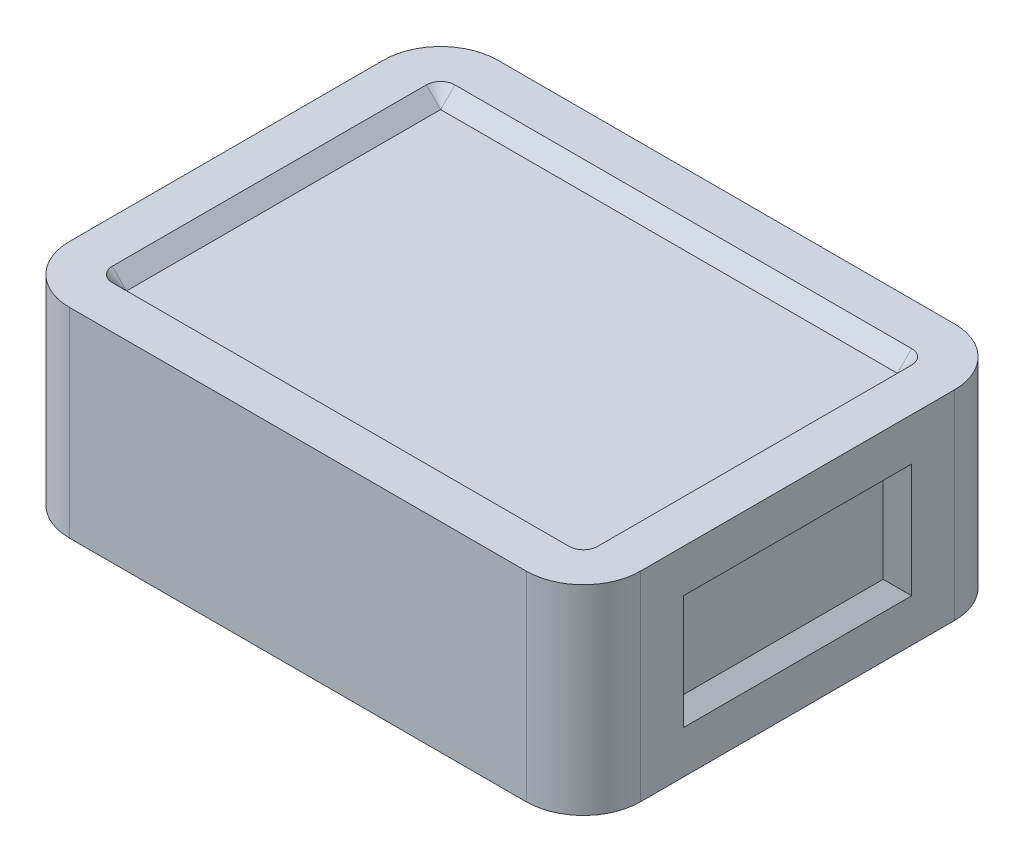
ISO-10303-21;
HEADER;
FILE_DESCRIPTION(('STEP AP214'),'2;1');
FILE_NAME('part.step','',(''),(''),'','','');
FILE_SCHEMA(('AUTOMOTIVE_DESIGN { 1 0 10303 214 1 1 1 1 }'));
ENDSEC;
DATA;
#1=APPLICATION_CONTEXT('core data for automotive mechanical design processes');
#2=APPLICATION_PROTOCOL_DEFINITION('international standard','automotive_design',2000,#1);
#3=PRODUCT_CONTEXT('',#1,'mechanical');
#4=PRODUCT('Part','Part','',(#3));
#5=PRODUCT_RELATED_PRODUCT_CATEGORY('part','',(#4));
#6=PRODUCT_DEFINITION_FORMATION('','',#4);
#7=PRODUCT_DEFINITION_CONTEXT('part definition',#1,'design');
#8=PRODUCT_DEFINITION('design','',#6,#7);
#9=PRODUCT_DEFINITION_SHAPE('','',#8);
#10=(LENGTH_UNIT() NAMED_UNIT(*) SI_UNIT(.MILLI.,.METRE.));
#11=(NAMED_UNIT(*) PLANE_ANGLE_UNIT() SI_UNIT($,.RADIAN.));
#12=(NAMED_UNIT(*) SI_UNIT($,.STERADIAN.) SOLID_ANGLE_UNIT());
#13=UNCERTAINTY_MEASURE_WITH_UNIT(LENGTH_MEASURE(1.E-05),#10,'distance_accuracy_value','');
#14=(GEOMETRIC_REPRESENTATION_CONTEXT(3) GLOBAL_UNCERTAINTY_ASSIGNED_CONTEXT((#13)) GLOBAL_UNIT_ASSIGNED_CONTEXT((#10,
#11,#12)) REPRESENTATION_CONTEXT('',''));
#15=CARTESIAN_POINT('',(0.,0.,0.));
#16=DIRECTION('',(0.,0.,1.));
#17=DIRECTION('',(1.,0.,0.));
#18=AXIS2_PLACEMENT_3D('',#15,#16,#17);
#19=CARTESIAN_POINT('',(20.,14.,-15.));
#20=DIRECTION('',(-1.,0.,0.));
#21=DIRECTION('',(0.,0.,1.));
#22=AXIS2_PLACEMENT_3D('',#19,#20,#21);
#23=PLANE('',#22);
#24=DIRECTION('',(0.,0.,-1.));
#25=VECTOR('',#24,1.);
#26=CARTESIAN_POINT('',(20.,3.,7.99999999999999));
#27=LINE('',#26,#25);
#28=CARTESIAN_POINT('',(20.,3.,7.99999999999999));
#29=VERTEX_POINT('',#28);
#30=CARTESIAN_POINT('',(20.,3.,-8.00000000000001));
#31=VERTEX_POINT('',#30);
#32=EDGE_CURVE('E172',#29,#31,#27,.T.);
#33=ORIENTED_EDGE('',*,*,#32,.F.);
#34=DIRECTION('',(0.,-1.,0.));
#35=VECTOR('',#34,1.);
#36=CARTESIAN_POINT('',(20.,11.,7.99999999999999));
#37=LINE('',#36,#35);
#38=CARTESIAN_POINT('',(20.,11.,7.99999999999999));
#39=VERTEX_POINT('',#38);
#40=EDGE_CURVE('E47',#39,#29,#37,.T.);
#41=ORIENTED_EDGE('',*,*,#40,.F.);
#42=DIRECTION('',(0.,0.,1.));
#43=VECTOR('',#42,1.);
#44=CARTESIAN_POINT('',(20.,11.,-8.00000000000001));
#45=LINE('',#44,#43);
#46=CARTESIAN_POINT('',(20.,11.,-8.00000000000001));
#47=VERTEX_POINT('',#46);
#48=EDGE_CURVE('E178',#47,#39,#45,.T.);
#49=ORIENTED_EDGE('',*,*,#48,.F.);
#50=DIRECTION('',(0.,1.,0.));
#51=VECTOR('',#50,1.);
#52=CARTESIAN_POINT('',(20.,3.,-8.00000000000001));
#53=LINE('',#52,#51);
#54=EDGE_CURVE('E161',#31,#47,#53,.T.);
#55=ORIENTED_EDGE('',*,*,#54,.F.);
#56=EDGE_LOOP('',(#33,#41,#49,#55));
#57=FACE_BOUND('',#56,.T.);
#58=DIRECTION('',(0.,0.,-1.));
#59=VECTOR('',#58,1.);
#60=CARTESIAN_POINT('',(20.,0.,-15.));
#61=LINE('',#60,#59);
#62=CARTESIAN_POINT('',(20.,0.,11.));
#63=VERTEX_POINT('',#62);
#64=CARTESIAN_POINT('',(20.,0.,-11.));
#65=VERTEX_POINT('',#64);
#66=EDGE_CURVE('E221',#63,#65,#61,.T.);
#67=ORIENTED_EDGE('',*,*,#66,.T.);
#68=DIRECTION('',(0.,-1.,0.));
#69=VECTOR('',#68,1.);
#70=CARTESIAN_POINT('',(20.,14.,-11.));
#71=LINE('',#70,#69);
#72=CARTESIAN_POINT('',(20.,14.,-11.));
#73=VERTEX_POINT('',#72);
#74=EDGE_CURVE('E11',#65,#73,#71,.F.);
#75=ORIENTED_EDGE('',*,*,#74,.T.);
#76=DIRECTION('',(0.,0.,-1.));
#77=VECTOR('',#76,1.);
#78=CARTESIAN_POINT('',(20.,14.,-15.));
#79=LINE('',#78,#77);
#80=CARTESIAN_POINT('',(20.,14.,11.));
#81=VERTEX_POINT('',#80);
#82=EDGE_CURVE('E247',#81,#73,#79,.T.);
#83=ORIENTED_EDGE('',*,*,#82,.F.);
#84=DIRECTION('',(0.,-1.,0.));
#85=VECTOR('',#84,1.);
#86=CARTESIAN_POINT('',(20.,14.,11.));
#87=LINE('',#86,#85);
#88=EDGE_CURVE('E40',#81,#63,#87,.T.);
#89=ORIENTED_EDGE('',*,*,#88,.T.);
#90=EDGE_LOOP('',(#67,#75,#83,#89));
#91=FACE_BOUND('',#90,.T.);
#92=ADVANCED_FACE('F32',(#57,#91),#23,.F.);
#93=CARTESIAN_POINT('',(-20.,14.,-15.));
#94=DIRECTION('',(0.,0.,1.));
#95=DIRECTION('',(1.,0.,0.));
#96=AXIS2_PLACEMENT_3D('',#93,#94,#95);
#97=PLANE('',#96);
#98=DIRECTION('',(-1.,0.,0.));
#99=VECTOR('',#98,1.);
#100=CARTESIAN_POINT('',(-20.,0.,-15.));
#101=LINE('',#100,#99);
#102=CARTESIAN_POINT('',(16.,0.,-15.));
#103=VERTEX_POINT('',#102);
#104=CARTESIAN_POINT('',(-16.,0.,-15.));
#105=VERTEX_POINT('',#104);
#106=EDGE_CURVE('E263',#103,#105,#101,.T.);
#107=ORIENTED_EDGE('',*,*,#106,.T.);
#108=DIRECTION('',(0.,-1.,0.));
#109=VECTOR('',#108,1.);
#110=CARTESIAN_POINT('',(-16.,14.,-15.));
#111=LINE('',#110,#109);
#112=CARTESIAN_POINT('',(-16.,14.,-15.));
#113=VERTEX_POINT('',#112);
#114=EDGE_CURVE('E286',#105,#113,#111,.F.);
#115=ORIENTED_EDGE('',*,*,#114,.T.);
#116=DIRECTION('',(-1.,0.,0.));
#117=VECTOR('',#116,1.);
#118=CARTESIAN_POINT('',(-20.,14.,-15.));
#119=LINE('',#118,#117);
#120=CARTESIAN_POINT('',(16.,14.,-15.));
#121=VERTEX_POINT('',#120);
#122=EDGE_CURVE('E250',#121,#113,#119,.T.);
#123=ORIENTED_EDGE('',*,*,#122,.F.);
#124=DIRECTION('',(0.,-1.,0.));
#125=VECTOR('',#124,1.);
#126=CARTESIAN_POINT('',(16.,14.,-15.));
#127=LINE('',#126,#125);
#128=EDGE_CURVE('E283',#121,#103,#127,.T.);
#129=ORIENTED_EDGE('',*,*,#128,.T.);
#130=EDGE_LOOP('',(#107,#115,#123,#129));
#131=FACE_BOUND('',#130,.T.);
#132=ADVANCED_FACE('F318',(#131),#97,.F.);
#133=CARTESIAN_POINT('',(-20.,14.,-15.));
#134=DIRECTION('',(1.,0.,0.));
#135=DIRECTION('',(0.,0.,-1.));
#136=AXIS2_PLACEMENT_3D('',#133,#134,#135);
#137=PLANE('',#136);
#138=DIRECTION('',(0.,0.,1.));
#139=VECTOR('',#138,1.);
#140=CARTESIAN_POINT('',(-20.,14.,-15.));
#141=LINE('',#140,#139);
#142=CARTESIAN_POINT('',(-20.,14.,-11.));
#143=VERTEX_POINT('',#142);
#144=CARTESIAN_POINT('',(-20.,14.,11.));
#145=VERTEX_POINT('',#144);
#146=EDGE_CURVE('E254',#143,#145,#141,.T.);
#147=ORIENTED_EDGE('',*,*,#146,.F.);
#148=DIRECTION('',(0.,-1.,0.));
#149=VECTOR('',#148,1.);
#150=CARTESIAN_POINT('',(-20.,14.,-11.));
#151=LINE('',#150,#149);
#152=CARTESIAN_POINT('',(-20.,0.,-11.));
#153=VERTEX_POINT('',#152);
#154=EDGE_CURVE('E272',#143,#153,#151,.T.);
#155=ORIENTED_EDGE('',*,*,#154,.T.);
#156=DIRECTION('',(0.,0.,1.));
#157=VECTOR('',#156,1.);
#158=CARTESIAN_POINT('',(-20.,0.,-15.));
#159=LINE('',#158,#157);
#160=CARTESIAN_POINT('',(-20.,0.,11.));
#161=VERTEX_POINT('',#160);
#162=EDGE_CURVE('E266',#153,#161,#159,.T.);
#163=ORIENTED_EDGE('',*,*,#162,.T.);
#164=DIRECTION('',(0.,-1.,0.));
#165=VECTOR('',#164,1.);
#166=CARTESIAN_POINT('',(-20.,14.,11.));
#167=LINE('',#166,#165);
#168=EDGE_CURVE('E260',#161,#145,#167,.F.);
#169=ORIENTED_EDGE('',*,*,#168,.T.);
#170=EDGE_LOOP('',(#147,#155,#163,#169));
#171=FACE_BOUND('',#170,.T.);
#172=ADVANCED_FACE('F328',(#171),#137,.F.);
#173=CARTESIAN_POINT('',(-20.,14.,15.));
#174=DIRECTION('',(0.,0.,-1.));
#175=DIRECTION('',(-1.,0.,0.));
#176=AXIS2_PLACEMENT_3D('',#173,#174,#175);
#177=PLANE('',#176);
#178=DIRECTION('',(1.,0.,0.));
#179=VECTOR('',#178,1.);
#180=CARTESIAN_POINT('',(-20.,14.,15.));
#181=LINE('',#180,#179);
#182=CARTESIAN_POINT('',(-16.,14.,15.));
#183=VERTEX_POINT('',#182);
#184=CARTESIAN_POINT('',(16.,14.,15.));
#185=VERTEX_POINT('',#184);
#186=EDGE_CURVE('E257',#183,#185,#181,.T.);
#187=ORIENTED_EDGE('',*,*,#186,.F.);
#188=DIRECTION('',(0.,-1.,0.));
#189=VECTOR('',#188,1.);
#190=CARTESIAN_POINT('',(-16.,14.,15.));
#191=LINE('',#190,#189);
#192=CARTESIAN_POINT('',(-16.,0.,15.));
#193=VERTEX_POINT('',#192);
#194=EDGE_CURVE('E298',#183,#193,#191,.T.);
#195=ORIENTED_EDGE('',*,*,#194,.T.);
#196=DIRECTION('',(1.,0.,0.));
#197=VECTOR('',#196,1.);
#198=CARTESIAN_POINT('',(-20.,0.,15.));
#199=LINE('',#198,#197);
#200=CARTESIAN_POINT('',(16.,0.,15.));
#201=VERTEX_POINT('',#200);
#202=EDGE_CURVE('E251',#193,#201,#199,.T.);
#203=ORIENTED_EDGE('',*,*,#202,.T.);
#204=DIRECTION('',(0.,-1.,0.));
#205=VECTOR('',#204,1.);
#206=CARTESIAN_POINT('',(16.,14.,15.));
#207=LINE('',#206,#205);
#208=EDGE_CURVE('E296',#201,#185,#207,.F.);
#209=ORIENTED_EDGE('',*,*,#208,.T.);
#210=EDGE_LOOP('',(#187,#195,#203,#209));
#211=FACE_BOUND('',#210,.T.);
#212=ADVANCED_FACE('F336',(#211),#177,.F.);
#213=CARTESIAN_POINT('',(0.,14.,0.));
#214=DIRECTION('',(0.,1.,0.));
#215=DIRECTION('',(0.,0.,1.));
#216=AXIS2_PLACEMENT_3D('',#213,#214,#215);
#217=PLANE('',#216);
#218=CARTESIAN_POINT('',(-16.,14.,-11.));
#219=DIRECTION('',(0.,1.,0.));
#220=DIRECTION('',(0.,0.,1.));
#221=AXIS2_PLACEMENT_3D('',#218,#219,#220);
#222=CIRCLE('',#221,1.);
#223=CARTESIAN_POINT('',(-16.,14.,-12.));
#224=VERTEX_POINT('',#223);
#225=CARTESIAN_POINT('',(-17.,14.,-11.));
#226=VERTEX_POINT('',#225);
#227=EDGE_CURVE('E55',#224,#226,#222,.T.);
#228=ORIENTED_EDGE('',*,*,#227,.F.);
#229=DIRECTION('',(-1.,0.,0.));
#230=VECTOR('',#229,1.);
#231=CARTESIAN_POINT('',(16.,14.,-12.));
#232=LINE('',#231,#230);
#233=CARTESIAN_POINT('',(16.,14.,-12.));
#234=VERTEX_POINT('',#233);
#235=EDGE_CURVE('E215',#234,#224,#232,.T.);
#236=ORIENTED_EDGE('',*,*,#235,.F.);
#237=CARTESIAN_POINT('',(16.,14.,-11.));
#238=DIRECTION('',(0.,1.,0.));
#239=DIRECTION('',(0.,0.,1.));
#240=AXIS2_PLACEMENT_3D('',#237,#238,#239);
#241=CIRCLE('',#240,1.);
#242=CARTESIAN_POINT('',(17.,14.,-11.));
#243=VERTEX_POINT('',#242);
#244=EDGE_CURVE('E212',#243,#234,#241,.T.);
#245=ORIENTED_EDGE('',*,*,#244,.F.);
#246=DIRECTION('',(0.,0.,-1.));
#247=VECTOR('',#246,1.);
#248=CARTESIAN_POINT('',(17.,14.,11.));
#249=LINE('',#248,#247);
#250=CARTESIAN_POINT('',(17.,14.,11.));
#251=VERTEX_POINT('',#250);
#252=EDGE_CURVE('E209',#251,#243,#249,.T.);
#253=ORIENTED_EDGE('',*,*,#252,.F.);
#254=CARTESIAN_POINT('',(16.,14.,11.));
#255=DIRECTION('',(0.,1.,0.));
#256=DIRECTION('',(0.,0.,1.));
#257=AXIS2_PLACEMENT_3D('',#254,#255,#256);
#258=CIRCLE('',#257,1.);
#259=CARTESIAN_POINT('',(16.,14.,12.));
#260=VERTEX_POINT('',#259);
#261=EDGE_CURVE('E206',#260,#251,#258,.T.);
#262=ORIENTED_EDGE('',*,*,#261,.F.);
#263=DIRECTION('',(1.,0.,0.));
#264=VECTOR('',#263,1.);
#265=CARTESIAN_POINT('',(-16.,14.,12.));
#266=LINE('',#265,#264);
#267=CARTESIAN_POINT('',(-16.,14.,12.));
#268=VERTEX_POINT('',#267);
#269=EDGE_CURVE('E203',#268,#260,#266,.T.);
#270=ORIENTED_EDGE('',*,*,#269,.F.);
#271=CARTESIAN_POINT('',(-16.,14.,11.));
#272=DIRECTION('',(0.,1.,0.));
#273=DIRECTION('',(0.,0.,1.));
#274=AXIS2_PLACEMENT_3D('',#271,#272,#273);
#275=CIRCLE('',#274,1.);
#276=CARTESIAN_POINT('',(-17.,14.,11.));
#277=VERTEX_POINT('',#276);
#278=EDGE_CURVE('E200',#277,#268,#275,.T.);
#279=ORIENTED_EDGE('',*,*,#278,.F.);
#280=DIRECTION('',(0.,0.,1.));
#281=VECTOR('',#280,1.);
#282=CARTESIAN_POINT('',(-17.,14.,-11.));
#283=LINE('',#282,#281);
#284=EDGE_CURVE('E197',#226,#277,#283,.T.);
#285=ORIENTED_EDGE('',*,*,#284,.F.);
#286=EDGE_LOOP('',(#228,#236,#245,#253,#262,#270,#279,#285));
#287=FACE_BOUND('',#286,.T.);
#288=ORIENTED_EDGE('',*,*,#122,.T.);
#289=CARTESIAN_POINT('',(-16.,14.,-11.));
#290=DIRECTION('',(0.,1.,0.));
#291=DIRECTION('',(0.,0.,1.));
#292=AXIS2_PLACEMENT_3D('',#289,#290,#291);
#293=CIRCLE('',#292,4.);
#294=EDGE_CURVE('E294',#113,#143,#293,.T.);
#295=ORIENTED_EDGE('',*,*,#294,.T.);
#296=ORIENTED_EDGE('',*,*,#146,.T.);
#297=CARTESIAN_POINT('',(-16.,14.,11.));
#298=DIRECTION('',(0.,1.,0.));
#299=DIRECTION('',(0.,0.,1.));
#300=AXIS2_PLACEMENT_3D('',#297,#298,#299);
#301=CIRCLE('',#300,4.);
#302=EDGE_CURVE('E292',#145,#183,#301,.T.);
#303=ORIENTED_EDGE('',*,*,#302,.T.);
#304=ORIENTED_EDGE('',*,*,#186,.T.);
#305=CARTESIAN_POINT('',(16.,14.,11.));
#306=DIRECTION('',(0.,1.,0.));
#307=DIRECTION('',(0.,0.,1.));
#308=AXIS2_PLACEMENT_3D('',#305,#306,#307);
#309=CIRCLE('',#308,4.);
#310=EDGE_CURVE('E288',#185,#81,#309,.T.);
#311=ORIENTED_EDGE('',*,*,#310,.T.);
#312=ORIENTED_EDGE('',*,*,#82,.T.);
#313=CARTESIAN_POINT('',(16.,14.,-11.));
#314=DIRECTION('',(0.,1.,0.));
#315=DIRECTION('',(0.,0.,1.));
#316=AXIS2_PLACEMENT_3D('',#313,#314,#315);
#317=CIRCLE('',#316,4.);
#318=EDGE_CURVE('E290',#73,#121,#317,.T.);
#319=ORIENTED_EDGE('',*,*,#318,.T.);
#320=EDGE_LOOP('',(#288,#295,#296,#303,#304,#311,#312,#319));
#321=FACE_BOUND('',#320,.T.);
#322=ADVANCED_FACE('F322',(#287,#321),#217,.T.);
#323=CARTESIAN_POINT('',(0.,0.,0.));
#324=DIRECTION('',(0.,1.,0.));
#325=DIRECTION('',(0.,0.,1.));
#326=AXIS2_PLACEMENT_3D('',#323,#324,#325);
#327=PLANE('',#326);
#328=ORIENTED_EDGE('',*,*,#162,.F.);
#329=CARTESIAN_POINT('',(-16.,0.,-11.));
#330=DIRECTION('',(0.,1.,0.));
#331=DIRECTION('',(0.,0.,1.));
#332=AXIS2_PLACEMENT_3D('',#329,#330,#331);
#333=CIRCLE('',#332,4.);
#334=EDGE_CURVE('E281',#153,#105,#333,.F.);
#335=ORIENTED_EDGE('',*,*,#334,.T.);
#336=ORIENTED_EDGE('',*,*,#106,.F.);
#337=CARTESIAN_POINT('',(16.,0.,-11.));
#338=DIRECTION('',(0.,1.,0.));
#339=DIRECTION('',(0.,0.,1.));
#340=AXIS2_PLACEMENT_3D('',#337,#338,#339);
#341=CIRCLE('',#340,4.);
#342=EDGE_CURVE('E277',#103,#65,#341,.F.);
#343=ORIENTED_EDGE('',*,*,#342,.T.);
#344=ORIENTED_EDGE('',*,*,#66,.F.);
#345=CARTESIAN_POINT('',(16.,0.,11.));
#346=DIRECTION('',(0.,1.,0.));
#347=DIRECTION('',(0.,0.,1.));
#348=AXIS2_PLACEMENT_3D('',#345,#346,#347);
#349=CIRCLE('',#348,4.);
#350=EDGE_CURVE('E275',#63,#201,#349,.F.);
#351=ORIENTED_EDGE('',*,*,#350,.T.);
#352=ORIENTED_EDGE('',*,*,#202,.F.);
#353=CARTESIAN_POINT('',(-16.,0.,11.));
#354=DIRECTION('',(0.,1.,0.));
#355=DIRECTION('',(0.,0.,1.));
#356=AXIS2_PLACEMENT_3D('',#353,#354,#355);
#357=CIRCLE('',#356,4.);
#358=EDGE_CURVE('E279',#193,#161,#357,.F.);
#359=ORIENTED_EDGE('',*,*,#358,.T.);
#360=EDGE_LOOP('',(#328,#335,#336,#343,#344,#351,#352,#359));
#361=FACE_BOUND('',#360,.T.);
#362=ADVANCED_FACE('F309',(#361),#327,.F.);
#363=CARTESIAN_POINT('',(-16.,14.,-11.));
#364=DIRECTION('',(0.,-1.,0.));
#365=DIRECTION('',(0.,0.,-1.));
#366=AXIS2_PLACEMENT_3D('',#363,#364,#365);
#367=CYLINDRICAL_SURFACE('',#366,4.);
#368=ORIENTED_EDGE('',*,*,#294,.F.);
#369=ORIENTED_EDGE('',*,*,#114,.F.);
#370=ORIENTED_EDGE('',*,*,#334,.F.);
#371=ORIENTED_EDGE('',*,*,#154,.F.);
#372=EDGE_LOOP('',(#368,#369,#370,#371));
#373=FACE_BOUND('',#372,.T.);
#374=ADVANCED_FACE('F326',(#373),#367,.T.);
#375=CARTESIAN_POINT('',(-16.,14.,11.));
#376=DIRECTION('',(0.,-1.,0.));
#377=DIRECTION('',(0.,0.,-1.));
#378=AXIS2_PLACEMENT_3D('',#375,#376,#377);
#379=CYLINDRICAL_SURFACE('',#378,4.);
#380=ORIENTED_EDGE('',*,*,#302,.F.);
#381=ORIENTED_EDGE('',*,*,#168,.F.);
#382=ORIENTED_EDGE('',*,*,#358,.F.);
#383=ORIENTED_EDGE('',*,*,#194,.F.);
#384=EDGE_LOOP('',(#380,#381,#382,#383));
#385=FACE_BOUND('',#384,.T.);
#386=ADVANCED_FACE('F333',(#385),#379,.T.);
#387=CARTESIAN_POINT('',(16.,14.,-11.));
#388=DIRECTION('',(0.,-1.,0.));
#389=DIRECTION('',(0.,0.,-1.));
#390=AXIS2_PLACEMENT_3D('',#387,#388,#389);
#391=CYLINDRICAL_SURFACE('',#390,4.);
#392=ORIENTED_EDGE('',*,*,#318,.F.);
#393=ORIENTED_EDGE('',*,*,#74,.F.);
#394=ORIENTED_EDGE('',*,*,#342,.F.);
#395=ORIENTED_EDGE('',*,*,#128,.F.);
#396=EDGE_LOOP('',(#392,#393,#394,#395));
#397=FACE_BOUND('',#396,.T.);
#398=ADVANCED_FACE('F315',(#397),#391,.T.);
#399=CARTESIAN_POINT('',(16.,14.,11.));
#400=DIRECTION('',(0.,-1.,0.));
#401=DIRECTION('',(0.,0.,-1.));
#402=AXIS2_PLACEMENT_3D('',#399,#400,#401);
#403=CYLINDRICAL_SURFACE('',#402,4.);
#404=ORIENTED_EDGE('',*,*,#310,.F.);
#405=ORIENTED_EDGE('',*,*,#208,.F.);
#406=ORIENTED_EDGE('',*,*,#350,.F.);
#407=ORIENTED_EDGE('',*,*,#88,.F.);
#408=EDGE_LOOP('',(#404,#405,#406,#407));
#409=FACE_BOUND('',#408,.T.);
#410=ADVANCED_FACE('F34',(#409),#403,.T.);
#411=CARTESIAN_POINT('',(-16.,14.,-11.));
#412=DIRECTION('',(0.,1.,0.));
#413=DIRECTION('',(0.,0.,1.));
#414=AXIS2_PLACEMENT_3D('',#411,#412,#413);
#415=CONICAL_SURFACE('',#414,1.,0.78539816339745);
#416=ORIENTED_EDGE('',*,*,#227,.T.);
#417=DIRECTION('',(-0.707106781186549,0.707106781186546,0.));
#418=VECTOR('',#417,1.);
#419=CARTESIAN_POINT('',(-17.,14.,-11.));
#420=LINE('',#419,#418);
#421=CARTESIAN_POINT('',(-16.,13.,-11.));
#422=VERTEX_POINT('',#421);
#423=EDGE_CURVE('E223',#422,#226,#420,.T.);
#424=ORIENTED_EDGE('',*,*,#423,.F.);
#425=DIRECTION('',(0.,0.707106781186546,-0.707106781186549));
#426=VECTOR('',#425,1.);
#427=CARTESIAN_POINT('',(-16.,14.,-12.));
#428=LINE('',#427,#426);
#429=EDGE_CURVE('E219',#422,#224,#428,.T.);
#430=ORIENTED_EDGE('',*,*,#429,.T.);
#431=EDGE_LOOP('',(#416,#424,#430));
#432=FACE_BOUND('',#431,.T.);
#433=ADVANCED_FACE('F339',(#432),#415,.F.);
#434=CARTESIAN_POINT('',(16.,14.,-12.));
#435=DIRECTION('',(0.,-0.707106781186549,-0.707106781186546));
#436=DIRECTION('',(0.,0.707106781186546,-0.707106781186549));
#437=AXIS2_PLACEMENT_3D('',#434,#435,#436);
#438=PLANE('',#437);
#439=ORIENTED_EDGE('',*,*,#235,.T.);
#440=ORIENTED_EDGE('',*,*,#429,.F.);
#441=DIRECTION('',(-1.,0.,0.));
#442=VECTOR('',#441,1.);
#443=CARTESIAN_POINT('',(-16.,13.,-11.));
#444=LINE('',#443,#442);
#445=CARTESIAN_POINT('',(16.,13.,-11.));
#446=VERTEX_POINT('',#445);
#447=EDGE_CURVE('E226',#446,#422,#444,.T.);
#448=ORIENTED_EDGE('',*,*,#447,.F.);
#449=DIRECTION('',(0.,0.707106781186546,-0.707106781186549));
#450=VECTOR('',#449,1.);
#451=CARTESIAN_POINT('',(16.,14.,-12.));
#452=LINE('',#451,#450);
#453=EDGE_CURVE('E222',#446,#234,#452,.T.);
#454=ORIENTED_EDGE('',*,*,#453,.T.);
#455=EDGE_LOOP('',(#439,#440,#448,#454));
#456=FACE_BOUND('',#455,.T.);
#457=ADVANCED_FACE('F344',(#456),#438,.F.);
#458=CARTESIAN_POINT('',(16.,14.,-11.));
#459=DIRECTION('',(0.,1.,0.));
#460=DIRECTION('',(0.,0.,1.));
#461=AXIS2_PLACEMENT_3D('',#458,#459,#460);
#462=CONICAL_SURFACE('',#461,1.,0.78539816339745);
#463=ORIENTED_EDGE('',*,*,#244,.T.);
#464=ORIENTED_EDGE('',*,*,#453,.F.);
#465=DIRECTION('',(0.707106781186549,0.707106781186546,0.));
#466=VECTOR('',#465,1.);
#467=CARTESIAN_POINT('',(17.,14.,-11.));
#468=LINE('',#467,#466);
#469=EDGE_CURVE('E234',#446,#243,#468,.T.);
#470=ORIENTED_EDGE('',*,*,#469,.T.);
#471=EDGE_LOOP('',(#463,#464,#470));
#472=FACE_BOUND('',#471,.T.);
#473=ADVANCED_FACE('F397',(#472),#462,.F.);
#474=CARTESIAN_POINT('',(17.,14.,11.));
#475=DIRECTION('',(0.707106781186546,-0.707106781186549,0.));
#476=DIRECTION('',(0.707106781186549,0.707106781186546,0.));
#477=AXIS2_PLACEMENT_3D('',#474,#475,#476);
#478=PLANE('',#477);
#479=ORIENTED_EDGE('',*,*,#252,.T.);
#480=ORIENTED_EDGE('',*,*,#469,.F.);
#481=DIRECTION('',(0.,0.,-1.));
#482=VECTOR('',#481,1.);
#483=CARTESIAN_POINT('',(16.,13.,-11.));
#484=LINE('',#483,#482);
#485=CARTESIAN_POINT('',(16.,13.,11.));
#486=VERTEX_POINT('',#485);
#487=EDGE_CURVE('E239',#486,#446,#484,.T.);
#488=ORIENTED_EDGE('',*,*,#487,.F.);
#489=DIRECTION('',(0.707106781186549,0.707106781186546,0.));
#490=VECTOR('',#489,1.);
#491=CARTESIAN_POINT('',(17.,14.,11.));
#492=LINE('',#491,#490);
#493=EDGE_CURVE('E232',#486,#251,#492,.T.);
#494=ORIENTED_EDGE('',*,*,#493,.T.);
#495=EDGE_LOOP('',(#479,#480,#488,#494));
#496=FACE_BOUND('',#495,.T.);
#497=ADVANCED_FACE('F407',(#496),#478,.F.);
#498=CARTESIAN_POINT('',(16.,14.,11.));
#499=DIRECTION('',(0.,1.,0.));
#500=DIRECTION('',(0.,0.,1.));
#501=AXIS2_PLACEMENT_3D('',#498,#499,#500);
#502=CONICAL_SURFACE('',#501,1.,0.78539816339745);
#503=ORIENTED_EDGE('',*,*,#261,.T.);
#504=ORIENTED_EDGE('',*,*,#493,.F.);
#505=DIRECTION('',(0.,0.707106781186546,0.707106781186549));
#506=VECTOR('',#505,1.);
#507=CARTESIAN_POINT('',(16.,14.,12.));
#508=LINE('',#507,#506);
#509=EDGE_CURVE('E230',#486,#260,#508,.T.);
#510=ORIENTED_EDGE('',*,*,#509,.T.);
#511=EDGE_LOOP('',(#503,#504,#510));
#512=FACE_BOUND('',#511,.T.);
#513=ADVANCED_FACE('F417',(#512),#502,.F.);
#514=CARTESIAN_POINT('',(-16.,14.,12.));
#515=DIRECTION('',(0.,-0.707106781186549,0.707106781186546));
#516=DIRECTION('',(0.,-0.707106781186546,-0.707106781186549));
#517=AXIS2_PLACEMENT_3D('',#514,#515,#516);
#518=PLANE('',#517);
#519=ORIENTED_EDGE('',*,*,#269,.T.);
#520=ORIENTED_EDGE('',*,*,#509,.F.);
#521=DIRECTION('',(1.,0.,0.));
#522=VECTOR('',#521,1.);
#523=CARTESIAN_POINT('',(-16.,13.,11.));
#524=LINE('',#523,#522);
#525=CARTESIAN_POINT('',(-16.,13.,11.));
#526=VERTEX_POINT('',#525);
#527=EDGE_CURVE('E242',#526,#486,#524,.T.);
#528=ORIENTED_EDGE('',*,*,#527,.F.);
#529=DIRECTION('',(0.,0.707106781186546,0.707106781186549));
#530=VECTOR('',#529,1.);
#531=CARTESIAN_POINT('',(-16.,14.,12.));
#532=LINE('',#531,#530);
#533=EDGE_CURVE('E228',#526,#268,#532,.T.);
#534=ORIENTED_EDGE('',*,*,#533,.T.);
#535=EDGE_LOOP('',(#519,#520,#528,#534));
#536=FACE_BOUND('',#535,.T.);
#537=ADVANCED_FACE('F427',(#536),#518,.F.);
#538=CARTESIAN_POINT('',(-16.,14.,11.));
#539=DIRECTION('',(0.,1.,0.));
#540=DIRECTION('',(0.,0.,1.));
#541=AXIS2_PLACEMENT_3D('',#538,#539,#540);
#542=CONICAL_SURFACE('',#541,1.,0.78539816339745);
#543=ORIENTED_EDGE('',*,*,#278,.T.);
#544=ORIENTED_EDGE('',*,*,#533,.F.);
#545=DIRECTION('',(-0.707106781186549,0.707106781186546,0.));
#546=VECTOR('',#545,1.);
#547=CARTESIAN_POINT('',(-17.,14.,11.));
#548=LINE('',#547,#546);
#549=EDGE_CURVE('E225',#526,#277,#548,.T.);
#550=ORIENTED_EDGE('',*,*,#549,.T.);
#551=EDGE_LOOP('',(#543,#544,#550));
#552=FACE_BOUND('',#551,.T.);
#553=ADVANCED_FACE('F437',(#552),#542,.F.);
#554=CARTESIAN_POINT('',(-17.,14.,-11.));
#555=DIRECTION('',(-0.707106781186546,-0.707106781186549,0.));
#556=DIRECTION('',(0.707106781186549,-0.707106781186546,0.));
#557=AXIS2_PLACEMENT_3D('',#554,#555,#556);
#558=PLANE('',#557);
#559=ORIENTED_EDGE('',*,*,#284,.T.);
#560=ORIENTED_EDGE('',*,*,#549,.F.);
#561=DIRECTION('',(0.,0.,1.));
#562=VECTOR('',#561,1.);
#563=CARTESIAN_POINT('',(-16.,13.,-11.));
#564=LINE('',#563,#562);
#565=EDGE_CURVE('E218',#422,#526,#564,.T.);
#566=ORIENTED_EDGE('',*,*,#565,.F.);
#567=ORIENTED_EDGE('',*,*,#423,.T.);
#568=EDGE_LOOP('',(#559,#560,#566,#567));
#569=FACE_BOUND('',#568,.T.);
#570=ADVANCED_FACE('F447',(#569),#558,.F.);
#571=CARTESIAN_POINT('',(-16.,13.,-11.));
#572=DIRECTION('',(0.,1.,0.));
#573=DIRECTION('',(0.,0.,1.));
#574=AXIS2_PLACEMENT_3D('',#571,#572,#573);
#575=PLANE('',#574);
#576=ORIENTED_EDGE('',*,*,#565,.T.);
#577=ORIENTED_EDGE('',*,*,#527,.T.);
#578=ORIENTED_EDGE('',*,*,#487,.T.);
#579=ORIENTED_EDGE('',*,*,#447,.T.);
#580=EDGE_LOOP('',(#576,#577,#578,#579));
#581=FACE_BOUND('',#580,.T.);
#582=ADVANCED_FACE('F457',(#581),#575,.T.);
#583=CARTESIAN_POINT('',(20.,11.,7.99999999999999));
#584=DIRECTION('',(-0.707106781186549,0.,0.707106781186546));
#585=DIRECTION('',(0.707106781186546,0.,0.707106781186549));
#586=AXIS2_PLACEMENT_3D('',#583,#584,#585);
#587=PLANE('',#586);
#588=ORIENTED_EDGE('',*,*,#40,.T.);
#589=DIRECTION('',(0.577350269189625,-0.577350269189626,0.577350269189626));
#590=VECTOR('',#589,1.);
#591=CARTESIAN_POINT('',(17.3333333333333,5.66666666666667,5.33333333333332));
#592=LINE('',#591,#590);
#593=CARTESIAN_POINT('',(19.,4.,6.99999999999999));
#594=VERTEX_POINT('',#593);
#595=EDGE_CURVE('E169',#594,#29,#592,.T.);
#596=ORIENTED_EDGE('',*,*,#595,.F.);
#597=DIRECTION('',(0.,-1.,0.));
#598=VECTOR('',#597,1.);
#599=CARTESIAN_POINT('',(19.,0.,6.99999999999999));
#600=LINE('',#599,#598);
#601=CARTESIAN_POINT('',(19.,9.99999999999999,6.99999999999999));
#602=VERTEX_POINT('',#601);
#603=EDGE_CURVE('E180',#602,#594,#600,.T.);
#604=ORIENTED_EDGE('',*,*,#603,.F.);
#605=DIRECTION('',(0.577350269189625,0.577350269189626,0.577350269189626));
#606=VECTOR('',#605,1.);
#607=CARTESIAN_POINT('',(14.6666666666667,5.66666666666665,2.66666666666665));
#608=LINE('',#607,#606);
#609=EDGE_CURVE('E184',#602,#39,#608,.T.);
#610=ORIENTED_EDGE('',*,*,#609,.T.);
#611=EDGE_LOOP('',(#588,#596,#604,#610));
#612=FACE_BOUND('',#611,.T.);
#613=ADVANCED_FACE('F466',(#612),#587,.F.);
#614=CARTESIAN_POINT('',(20.,11.,-8.00000000000001));
#615=DIRECTION('',(-0.707106781186549,0.707106781186546,0.));
#616=DIRECTION('',(-0.707106781186546,-0.707106781186549,0.));
#617=AXIS2_PLACEMENT_3D('',#614,#615,#616);
#618=PLANE('',#617);
#619=ORIENTED_EDGE('',*,*,#48,.T.);
#620=ORIENTED_EDGE('',*,*,#609,.F.);
#621=DIRECTION('',(0.,0.,1.));
#622=VECTOR('',#621,1.);
#623=CARTESIAN_POINT('',(19.,9.99999999999999,0.));
#624=LINE('',#623,#622);
#625=CARTESIAN_POINT('',(19.,9.99999999999999,-7.));
#626=VERTEX_POINT('',#625);
#627=EDGE_CURVE('E186',#626,#602,#624,.T.);
#628=ORIENTED_EDGE('',*,*,#627,.F.);
#629=DIRECTION('',(0.577350269189624,0.577350269189627,-0.577350269189627));
#630=VECTOR('',#629,1.);
#631=CARTESIAN_POINT('',(17.3333333333333,8.33333333333333,-5.33333333333333));
#632=LINE('',#631,#630);
#633=EDGE_CURVE('E168',#626,#47,#632,.T.);
#634=ORIENTED_EDGE('',*,*,#633,.T.);
#635=EDGE_LOOP('',(#619,#620,#628,#634));
#636=FACE_BOUND('',#635,.T.);
#637=ADVANCED_FACE('F482',(#636),#618,.F.);
#638=CARTESIAN_POINT('',(20.,3.,-8.00000000000001));
#639=DIRECTION('',(-0.707106781186549,0.,-0.707106781186546));
#640=DIRECTION('',(-0.707106781186546,0.,0.707106781186549));
#641=AXIS2_PLACEMENT_3D('',#638,#639,#640);
#642=PLANE('',#641);
#643=ORIENTED_EDGE('',*,*,#54,.T.);
#644=ORIENTED_EDGE('',*,*,#633,.F.);
#645=DIRECTION('',(0.,1.,0.));
#646=VECTOR('',#645,1.);
#647=CARTESIAN_POINT('',(19.,0.,-7.));
#648=LINE('',#647,#646);
#649=CARTESIAN_POINT('',(19.,4.,-7.));
#650=VERTEX_POINT('',#649);
#651=EDGE_CURVE('E164',#650,#626,#648,.T.);
#652=ORIENTED_EDGE('',*,*,#651,.F.);
#653=DIRECTION('',(0.577350269189624,-0.577350269189627,-0.577350269189627));
#654=VECTOR('',#653,1.);
#655=CARTESIAN_POINT('',(14.6666666666667,8.33333333333334,-2.66666666666666));
#656=LINE('',#655,#654);
#657=EDGE_CURVE('E157',#650,#31,#656,.T.);
#658=ORIENTED_EDGE('',*,*,#657,.T.);
#659=EDGE_LOOP('',(#643,#644,#652,#658));
#660=FACE_BOUND('',#659,.T.);
#661=ADVANCED_FACE('F159',(#660),#642,.F.);
#662=CARTESIAN_POINT('',(20.,3.,7.99999999999999));
#663=DIRECTION('',(-0.707106781186549,-0.707106781186546,0.));
#664=DIRECTION('',(0.707106781186546,-0.707106781186549,0.));
#665=AXIS2_PLACEMENT_3D('',#662,#663,#664);
#666=PLANE('',#665);
#667=ORIENTED_EDGE('',*,*,#32,.T.);
#668=ORIENTED_EDGE('',*,*,#657,.F.);
#669=DIRECTION('',(0.,0.,-1.));
#670=VECTOR('',#669,1.);
#671=CARTESIAN_POINT('',(19.,4.,0.));
#672=LINE('',#671,#670);
#673=EDGE_CURVE('E191',#594,#650,#672,.T.);
#674=ORIENTED_EDGE('',*,*,#673,.F.);
#675=ORIENTED_EDGE('',*,*,#595,.T.);
#676=EDGE_LOOP('',(#667,#668,#674,#675));
#677=FACE_BOUND('',#676,.T.);
#678=ADVANCED_FACE('F173',(#677),#666,.F.);
#679=CARTESIAN_POINT('',(19.,0.,0.));
#680=DIRECTION('',(1.,0.,0.));
#681=DIRECTION('',(0.,0.,-1.));
#682=AXIS2_PLACEMENT_3D('',#679,#680,#681);
#683=PLANE('',#682);
#684=ORIENTED_EDGE('',*,*,#603,.T.);
#685=ORIENTED_EDGE('',*,*,#673,.T.);
#686=ORIENTED_EDGE('',*,*,#651,.T.);
#687=ORIENTED_EDGE('',*,*,#627,.T.);
#688=EDGE_LOOP('',(#684,#685,#686,#687));
#689=FACE_BOUND('',#688,.T.);
#690=ADVANCED_FACE('F508',(#689),#683,.T.);
#691=CLOSED_SHELL('',(#92,#132,#172,#212,#322,#362,#374,#386,#398,#410,#433,#457,#473,#497,#513,
#537,#553,#570,#582,#613,#637,#661,#678,#690));
#692=MANIFOLD_SOLID_BREP('B2',#691);
#693=ADVANCED_BREP_SHAPE_REPRESENTATION('',(#18,#692),#14);
#694=SHAPE_DEFINITION_REPRESENTATION(#9,#693);
ENDSEC;
END-ISO-10303-21;
